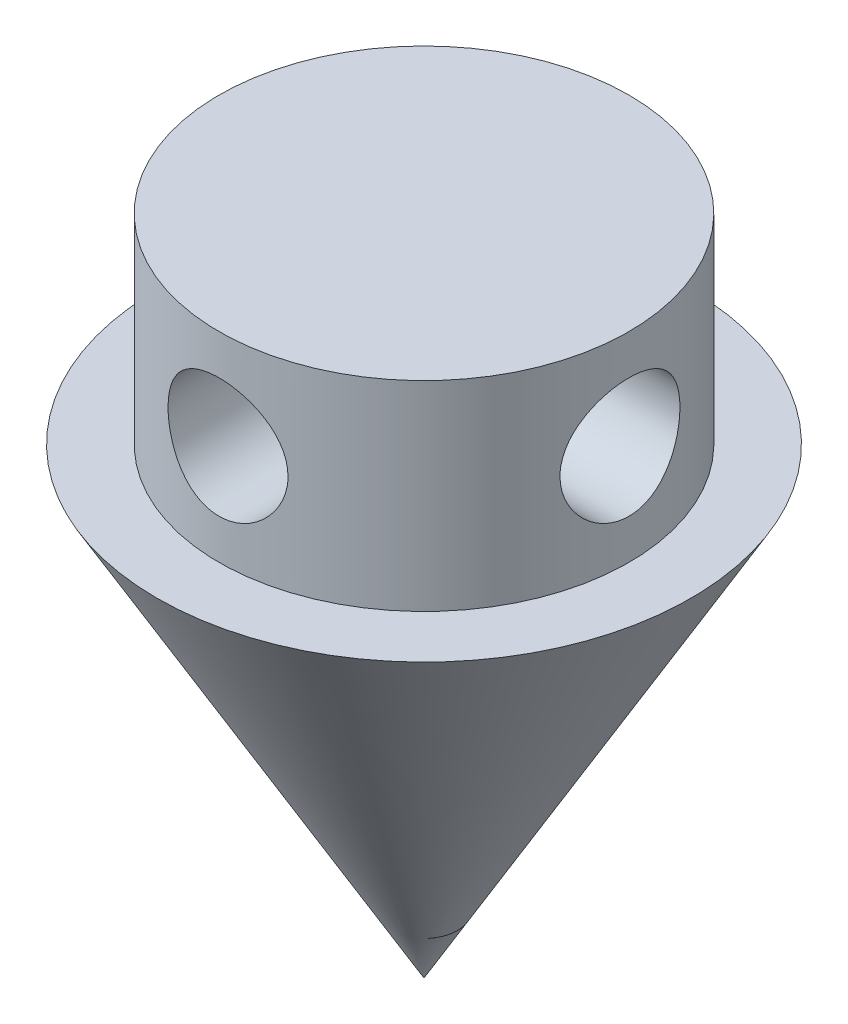
ISO-10303-21;
HEADER;
FILE_DESCRIPTION(('STEP AP214'),'2;1');
FILE_NAME('part.step','',(''),(''),'','','');
FILE_SCHEMA(('AUTOMOTIVE_DESIGN { 1 0 10303 214 1 1 1 1 }'));
ENDSEC;
DATA;
#1=APPLICATION_CONTEXT('core data for automotive mechanical design processes');
#2=APPLICATION_PROTOCOL_DEFINITION('international standard','automotive_design',2000,#1);
#3=PRODUCT_CONTEXT('',#1,'mechanical');
#4=PRODUCT('Part','Part','',(#3));
#5=PRODUCT_RELATED_PRODUCT_CATEGORY('part','',(#4));
#6=PRODUCT_DEFINITION_FORMATION('','',#4);
#7=PRODUCT_DEFINITION_CONTEXT('part definition',#1,'design');
#8=PRODUCT_DEFINITION('design','',#6,#7);
#9=PRODUCT_DEFINITION_SHAPE('','',#8);
#10=(LENGTH_UNIT() NAMED_UNIT(*) SI_UNIT(.MILLI.,.METRE.));
#11=(NAMED_UNIT(*) PLANE_ANGLE_UNIT() SI_UNIT($,.RADIAN.));
#12=(NAMED_UNIT(*) SI_UNIT($,.STERADIAN.) SOLID_ANGLE_UNIT());
#13=UNCERTAINTY_MEASURE_WITH_UNIT(LENGTH_MEASURE(1.E-05),#10,'distance_accuracy_value','');
#14=(GEOMETRIC_REPRESENTATION_CONTEXT(3) GLOBAL_UNCERTAINTY_ASSIGNED_CONTEXT((#13)) GLOBAL_UNIT_ASSIGNED_CONTEXT((#10,
#11,#12)) REPRESENTATION_CONTEXT('',''));
#15=CARTESIAN_POINT('',(0.,0.,0.));
#16=DIRECTION('',(0.,0.,1.));
#17=DIRECTION('',(1.,0.,0.));
#18=AXIS2_PLACEMENT_3D('',#15,#16,#17);
#19=CARTESIAN_POINT('',(0.,11.5614391405224,-13.35));
#20=DIRECTION('',(0.,0.,1.));
#21=DIRECTION('',(1.,0.,0.));
#22=AXIS2_PLACEMENT_3D('',#19,#20,#21);
#23=CYLINDRICAL_SURFACE('',#22,3.);
#24=CARTESIAN_POINT('',(3.,11.5614391405224,9.80114789195633));
#25=CARTESIAN_POINT('',(2.99999746175985,11.7260295810798,9.80114992506124));
#26=CARTESIAN_POINT('',(2.9864088999702,11.8906453429548,9.80533920128403));
#27=CARTESIAN_POINT('',(2.9325451017023,12.2150775547996,9.82158066680453));
#28=CARTESIAN_POINT('',(2.89225995318095,12.3748921991394,9.83363577654289));
#29=CARTESIAN_POINT('',(2.78647726144655,12.6849795507611,9.86412916611665));
#30=CARTESIAN_POINT('',(2.72102014804028,12.8352671113289,9.88255720535236));
#31=CARTESIAN_POINT('',(2.56688318178323,13.122761673286,9.92370640928456));
#32=CARTESIAN_POINT('',(2.47820022078772,13.2599669206106,9.946428148462));
#33=CARTESIAN_POINT('',(2.27726971309996,13.5215347739714,9.99437203581521));
#34=CARTESIAN_POINT('',(2.16444543498224,13.6454450472232,10.0196454780748));
#35=CARTESIAN_POINT('',(1.91967193383097,13.8728837589447,10.0694059010803));
#36=CARTESIAN_POINT('',(1.7877203710043,13.9764097001907,10.0938927851603));
#37=CARTESIAN_POINT('',(1.50523867042067,14.1620872958486,10.139901401077));
#38=CARTESIAN_POINT('',(1.35439515328406,14.2437803768345,10.1613556295932));
#39=CARTESIAN_POINT('',(1.04037763848688,14.3804671230856,10.1982873756147));
#40=CARTESIAN_POINT('',(0.877206173671745,14.4354662556248,10.213766116846));
#41=CARTESIAN_POINT('',(0.547894519269676,14.5157145269893,10.236639974182));
#42=CARTESIAN_POINT('',(0.381957126992254,14.5417351679288,10.24424432305));
#43=CARTESIAN_POINT('',(0.0479094620364565,14.5657245287612,10.2512482234745));
#44=CARTESIAN_POINT('',(-0.120200368782222,14.5636988660886,10.2506494180528));
#45=CARTESIAN_POINT('',(-0.448418210461296,14.5321768164533,10.2414636207862));
#46=CARTESIAN_POINT('',(-0.608614274223889,14.5035154368434,10.2331194489363));
#47=CARTESIAN_POINT('',(-0.921814438610707,14.4208960860025,10.209673607781));
#48=CARTESIAN_POINT('',(-1.07481809196999,14.3669365438717,10.1945715188427));
#49=CARTESIAN_POINT('',(-1.37130845089546,14.2346704568653,10.1589654768266));
#50=CARTESIAN_POINT('',(-1.51466825619629,14.1560959987988,10.1384024806187));
#51=CARTESIAN_POINT('',(-1.78643893277547,13.977040891629,10.0940637887971));
#52=CARTESIAN_POINT('',(-1.91484638560313,13.8765552481512,10.0702873611935));
#53=CARTESIAN_POINT('',(-2.1580517297572,13.6521755343641,10.0210421709353));
#54=CARTESIAN_POINT('',(-2.2721757449232,13.5275567062545,9.99554332724818));
#55=CARTESIAN_POINT('',(-2.47809018400086,13.2606965357992,9.94649703006864));
#56=CARTESIAN_POINT('',(-2.56987860504909,13.1184536148016,9.92294975170056));
#57=CARTESIAN_POINT('',(-2.72917424680686,12.8186813831543,9.88033381262632));
#58=CARTESIAN_POINT('',(-2.79646225313558,12.6610293423766,9.86130609096126));
#59=CARTESIAN_POINT('',(-2.90334074684968,12.3359475949958,9.83037351588997));
#60=CARTESIAN_POINT('',(-2.94293976047318,12.1685209155069,9.81846646998626));
#61=CARTESIAN_POINT('',(-2.99207926894961,11.8350310676649,9.8036014548583));
#62=CARTESIAN_POINT('',(-3.00263977750297,11.6691315934016,9.80033995432809));
#63=CARTESIAN_POINT('',(-2.99624231123474,11.3379292131317,9.80229797235934));
#64=CARTESIAN_POINT('',(-2.97928796892288,11.1726262312635,9.80751637140484));
#65=CARTESIAN_POINT('',(-2.9192485186782,10.8514878004266,9.82554934012221));
#66=CARTESIAN_POINT('',(-2.87681014585225,10.6955198079814,9.83817573292395));
#67=CARTESIAN_POINT('',(-2.76775194430911,10.3929251826043,9.86940957925653));
#68=CARTESIAN_POINT('',(-2.70112850661661,10.2462999476704,9.88801792538677));
#69=CARTESIAN_POINT('',(-2.54362592823572,9.96237722628921,9.92971539413577));
#70=CARTESIAN_POINT('',(-2.45216608315492,9.82541739064745,9.95290760824183));
#71=CARTESIAN_POINT('',(-2.24828329325139,9.56841601737129,10.0009335170437));
#72=CARTESIAN_POINT('',(-2.13585557596368,9.44837834230714,10.0257675846069));
#73=CARTESIAN_POINT('',(-1.88845042382828,9.22421963152815,10.0753512544242));
#74=CARTESIAN_POINT('',(-1.75281164397313,9.12081914605287,10.100066240598));
#75=CARTESIAN_POINT('',(-1.46552498874078,8.93823554808286,10.1457310844248));
#76=CARTESIAN_POINT('',(-1.31387793387754,8.85905119518533,10.1666811349032));
#77=CARTESIAN_POINT('',(-0.999909698792418,8.72790903687179,10.2023244539059));
#78=CARTESIAN_POINT('',(-0.837679874226138,8.67574593463424,10.2170647367549));
#79=CARTESIAN_POINT('',(-0.506250974025879,8.59958158691794,10.2388353876572));
#80=CARTESIAN_POINT('',(-0.337053800592509,8.57557270695177,10.245867845782));
#81=CARTESIAN_POINT('',(-0.00316772558191911,8.55695601800593,10.2513096938205));
#82=CARTESIAN_POINT('',(0.161458511169612,8.5613007294914,10.2500263123235));
#83=CARTESIAN_POINT('',(0.487535879532566,8.59678029756934,10.2396980948439));
#84=CARTESIAN_POINT('',(0.648987176021527,8.62791375921972,10.2306536629944));
#85=CARTESIAN_POINT('',(0.962601891125669,8.71545043788882,10.205901392709));
#86=CARTESIAN_POINT('',(1.11484075406039,8.77160332165168,10.1902596448812));
#87=CARTESIAN_POINT('',(1.40781835147558,8.90736174913451,10.1539334098905));
#88=CARTESIAN_POINT('',(1.54855524567556,8.98697103646166,10.1332481178764));
#89=CARTESIAN_POINT('',(1.81924959858925,9.17023355330338,10.0882233660288));
#90=CARTESIAN_POINT('',(1.94874063394236,9.27455270888884,10.0637908696803));
#91=CARTESIAN_POINT('',(2.18873061905263,9.50306014459776,10.0143398114442));
#92=CARTESIAN_POINT('',(2.29922419747139,9.62725402499714,9.98932108607079));
#93=CARTESIAN_POINT('',(2.50117621745975,9.89615525781999,9.94071065978621));
#94=CARTESIAN_POINT('',(2.59201612251893,10.0413390416371,9.9171784098105));
#95=CARTESIAN_POINT('',(2.74788601828594,10.3455850809944,9.87512931521937));
#96=CARTESIAN_POINT('',(2.8129294825627,10.504640038474,9.85660985401649));
#97=CARTESIAN_POINT('',(2.9088796666691,10.8123243873279,9.82868775299289));
#98=CARTESIAN_POINT('',(2.94295899417231,10.9598951243816,9.81845454172528));
#99=CARTESIAN_POINT('',(2.98851832278478,11.2587835982606,9.80468427057592));
#100=CARTESIAN_POINT('',(3.00000233387427,11.410100665399,9.80114602254644));
#101=CARTESIAN_POINT('',(3.,11.5614391405224,9.80114789195633));
#102=B_SPLINE_CURVE_WITH_KNOTS('',3,(#24,#25,#26,#27,#28,#29,#30,#31,#32,#33,#34,#35,#36,#37,
#38,#39,#40,#41,#42,#43,#44,#45,#46,#47,#48,#49,#50,#51,#52,#53,#54,#55,#56,#57,#58,#59,#60,#61,
#62,#63,#64,#65,#66,#67,#68,#69,#70,#71,#72,#73,#74,#75,#76,#77,#78,#79,#80,#81,#82,#83,#84,#85,
#86,#87,#88,#89,#90,#91,#92,#93,#94,#95,#96,#97,#98,#99,#100,#101),.UNSPECIFIED.,.T.,.F.,(4,2,2,
2,2,2,2,2,2,2,2,2,2,2,2,2,2,2,2,2,2,2,2,2,2,2,2,2,2,2,2,2,2,2,2,2,2,2,4),(0.,0.493213477867735,
0.986610181193144,1.47921770591635,1.97189118640388,2.47800183300104,2.98417444318164,
3.50026538700252,4.01625058391556,4.51814325809275,5.01993540892036,5.50650898832165,
5.9931127857135,6.48520851873253,6.9774165361481,7.48771965766661,7.99806852191934,
8.51287754331124,9.02752797028817,9.52385463831019,10.0201157866316,10.5042856424841,
10.9885277774821,11.48524602015,11.9820774583721,12.496632374002,13.0111609285975,
13.5217207430717,14.0321420786904,14.5238162221269,15.0154647646882,15.5023008584727,
15.9892146927003,16.4911482002169,16.9932233917966,17.5093353003962,18.0251772858578,
18.4787602865289,18.9322627827738),.UNSPECIFIED.);
#103=CARTESIAN_POINT('',(3.,11.5614391405224,9.80114789195633));
#104=VERTEX_POINT('',#103);
#105=EDGE_CURVE('E87',#104,#104,#102,.T.);
#106=ORIENTED_EDGE('',*,*,#105,.T.);
#107=EDGE_LOOP('',(#106));
#108=FACE_BOUND('',#107,.T.);
#109=CARTESIAN_POINT('',(0.,11.5614391405224,0.));
#110=DIRECTION('',(0.707106781186546,0.,0.707106781186549));
#111=DIRECTION('',(-0.707106781186549,0.,0.707106781186546));
#112=AXIS2_PLACEMENT_3D('',#109,#110,#111);
#113=ELLIPSE('',#112,4.24264068711928,3.);
#114=CARTESIAN_POINT('',(0.,8.56143914052242,0.));
#115=VERTEX_POINT('',#114);
#116=CARTESIAN_POINT('',(0.,14.5614391405224,0.));
#117=VERTEX_POINT('',#116);
#118=EDGE_CURVE('E52',#115,#117,#113,.F.);
#119=ORIENTED_EDGE('',*,*,#118,.T.);
#120=CARTESIAN_POINT('',(0.,11.5614391405224,0.));
#121=DIRECTION('',(-0.707106781186549,0.,0.707106781186546));
#122=DIRECTION('',(0.707106781186546,0.,0.707106781186549));
#123=AXIS2_PLACEMENT_3D('',#120,#121,#122);
#124=ELLIPSE('',#123,4.24264068711929,3.);
#125=EDGE_CURVE('E11',#117,#115,#124,.F.);
#126=ORIENTED_EDGE('',*,*,#125,.T.);
#127=EDGE_LOOP('',(#119,#126));
#128=FACE_BOUND('',#127,.T.);
#129=ADVANCED_FACE('F38',(#108,#128),#23,.F.);
#130=CARTESIAN_POINT('',(0.,-16.5614391405224,0.));
#131=DIRECTION('',(0.,1.,0.));
#132=DIRECTION('',(0.,0.,1.));
#133=AXIS2_PLACEMENT_3D('',#130,#131,#132);
#134=CONICAL_SURFACE('',#133,0.,0.523598775598293);
#135=CARTESIAN_POINT('',(0.,6.56143914052242,0.));
#136=DIRECTION('',(0.,-1.,0.));
#137=DIRECTION('',(0.,0.,-1.));
#138=AXIS2_PLACEMENT_3D('',#135,#136,#137);
#139=CIRCLE('',#138,13.35);
#140=CARTESIAN_POINT('',(0.,6.56143914052242,-13.35));
#141=VERTEX_POINT('',#140);
#142=EDGE_CURVE('E71',#141,#141,#139,.T.);
#143=ORIENTED_EDGE('',*,*,#142,.T.);
#144=EDGE_LOOP('',(#143));
#145=FACE_BOUND('',#144,.T.);
#146=CARTESIAN_POINT('',(0.,-16.5614391405224,0.));
#147=VERTEX_POINT('',#146);
#148=VERTEX_LOOP('',#147);
#149=FACE_BOUND('',#148,.T.);
#150=ADVANCED_FACE('F40',(#145,#149),#134,.T.);
#151=CARTESIAN_POINT('',(10.25,6.56143914052242,0.));
#152=DIRECTION('',(0.,1.,0.));
#153=DIRECTION('',(0.,0.,1.));
#154=AXIS2_PLACEMENT_3D('',#151,#152,#153);
#155=PLANE('',#154);
#156=CARTESIAN_POINT('',(0.,6.56143914052242,0.));
#157=DIRECTION('',(0.,-1.,0.));
#158=DIRECTION('',(0.,0.,-1.));
#159=AXIS2_PLACEMENT_3D('',#156,#157,#158);
#160=CIRCLE('',#159,10.25);
#161=CARTESIAN_POINT('',(0.,6.56143914052242,-10.25));
#162=VERTEX_POINT('',#161);
#163=EDGE_CURVE('E140',#162,#162,#160,.T.);
#164=ORIENTED_EDGE('',*,*,#163,.T.);
#165=EDGE_LOOP('',(#164));
#166=FACE_BOUND('',#165,.T.);
#167=ORIENTED_EDGE('',*,*,#142,.F.);
#168=EDGE_LOOP('',(#167));
#169=FACE_BOUND('',#168,.T.);
#170=ADVANCED_FACE('F108',(#166,#169),#155,.T.);
#171=CARTESIAN_POINT('',(0.,-24.573828125,0.));
#172=DIRECTION('',(0.,-1.,0.));
#173=DIRECTION('',(0.,0.,-1.));
#174=AXIS2_PLACEMENT_3D('',#171,#172,#173);
#175=CYLINDRICAL_SURFACE('',#174,10.25);
#176=CARTESIAN_POINT('',(9.80114789195632,11.5614391405224,3.00000000000004));
#177=CARTESIAN_POINT('',(9.80114992506123,11.396848699965,2.99999746175989));
#178=CARTESIAN_POINT('',(9.80533920128402,11.23223293809,2.98640889997023));
#179=CARTESIAN_POINT('',(9.82158066680452,10.9078007262452,2.93254510170233));
#180=CARTESIAN_POINT('',(9.83363577654288,10.7479860819054,2.89225995318098));
#181=CARTESIAN_POINT('',(9.86412916611664,10.4378987302838,2.78647726144659));
#182=CARTESIAN_POINT('',(9.88255720535235,10.2876111697159,2.72102014804032));
#183=CARTESIAN_POINT('',(9.92370640928455,10.0001166077588,2.56688318178327));
#184=CARTESIAN_POINT('',(9.946428148462,9.86291136043424,2.47820022078775));
#185=CARTESIAN_POINT('',(9.9943720358152,9.60134350707341,2.27726971309999));
#186=CARTESIAN_POINT('',(10.0196454780748,9.47743323382164,2.16444543498228));
#187=CARTESIAN_POINT('',(10.0694059010803,9.24999452210014,1.91967193383101));
#188=CARTESIAN_POINT('',(10.0938927851603,9.14646858085418,1.78772037100434));
#189=CARTESIAN_POINT('',(10.139901401077,8.96079098519629,1.5052386704207));
#190=CARTESIAN_POINT('',(10.1613556295932,8.87909790421037,1.3543951532841));
#191=CARTESIAN_POINT('',(10.1982873756147,8.74241115795922,1.04037763848692));
#192=CARTESIAN_POINT('',(10.213766116846,8.68741202542006,0.877206173671781));
#193=CARTESIAN_POINT('',(10.236639974182,8.60716375405558,0.547894519269712));
#194=CARTESIAN_POINT('',(10.24424432305,8.58114311311608,0.381957126992291));
#195=CARTESIAN_POINT('',(10.2512482234745,8.55715375228361,0.0479094620364925));
#196=CARTESIAN_POINT('',(10.2506494180528,8.55917941495624,-0.120200368782186));
#197=CARTESIAN_POINT('',(10.2414636207862,8.5907014645915,-0.448418210461261));
#198=CARTESIAN_POINT('',(10.2331194489363,8.61936284420148,-0.608614274223853));
#199=CARTESIAN_POINT('',(10.209673607781,8.70198219504235,-0.921814438610672));
#200=CARTESIAN_POINT('',(10.1945715188427,8.75594173717313,-1.07481809196995));
#201=CARTESIAN_POINT('',(10.1589654768266,8.88820782417959,-1.37130845089543));
#202=CARTESIAN_POINT('',(10.1384024806187,8.96678228224605,-1.51466825619626));
#203=CARTESIAN_POINT('',(10.0940637887972,9.14583738941588,-1.78643893277544));
#204=CARTESIAN_POINT('',(10.0702873611935,9.24632303289362,-1.9148463856031));
#205=CARTESIAN_POINT('',(10.0210421709354,9.47070274668069,-2.15805172975717));
#206=CARTESIAN_POINT('',(9.99554332724819,9.5953215747903,-2.27217574492316));
#207=CARTESIAN_POINT('',(9.94649703006865,9.86218174524562,-2.47809018400083));
#208=CARTESIAN_POINT('',(9.92294975170057,10.0044246662433,-2.56987860504905));
#209=CARTESIAN_POINT('',(9.88033381262633,10.3041968978905,-2.72917424680682));
#210=CARTESIAN_POINT('',(9.86130609096127,10.4618489386683,-2.79646225313554));
#211=CARTESIAN_POINT('',(9.83037351588998,10.786930686049,-2.90334074684965));
#212=CARTESIAN_POINT('',(9.81846646998626,10.954357365538,-2.94293976047314));
#213=CARTESIAN_POINT('',(9.80360145485831,11.2878472133799,-2.99207926894958));
#214=CARTESIAN_POINT('',(9.8003399543281,11.4537466876432,-3.00263977750294));
#215=CARTESIAN_POINT('',(9.80229797235935,11.7849490679132,-2.99624231123471));
#216=CARTESIAN_POINT('',(9.80751637140485,11.9502520497814,-2.97928796892284));
#217=CARTESIAN_POINT('',(9.82554934012222,12.2713904806182,-2.91924851867816));
#218=CARTESIAN_POINT('',(9.83817573292396,12.4273584730635,-2.87681014585222));
#219=CARTESIAN_POINT('',(9.86940957925654,12.7299530984405,-2.76775194430907));
#220=CARTESIAN_POINT('',(9.88801792538677,12.8765783333745,-2.70112850661658));
#221=CARTESIAN_POINT('',(9.92971539413578,13.1605010547556,-2.54362592823568));
#222=CARTESIAN_POINT('',(9.95290760824184,13.2974608903974,-2.45216608315488));
#223=CARTESIAN_POINT('',(10.0009335170437,13.5544622636736,-2.24828329325135));
#224=CARTESIAN_POINT('',(10.0257675846069,13.6744999387377,-2.13585557596364));
#225=CARTESIAN_POINT('',(10.0753512544242,13.8986586495167,-1.88845042382824));
#226=CARTESIAN_POINT('',(10.100066240598,14.002059134992,-1.7528116439731));
#227=CARTESIAN_POINT('',(10.1457310844248,14.184642732962,-1.46552498874074));
#228=CARTESIAN_POINT('',(10.1666811349032,14.2638270858595,-1.31387793387751));
#229=CARTESIAN_POINT('',(10.2023244539059,14.3949692441731,-0.999909698792381));
#230=CARTESIAN_POINT('',(10.2170647367549,14.4471323464106,-0.837679874226101));
#231=CARTESIAN_POINT('',(10.2388353876572,14.5232966941269,-0.506250974025841));
#232=CARTESIAN_POINT('',(10.245867845782,14.5473055740931,-0.337053800592471));
#233=CARTESIAN_POINT('',(10.2513096938205,14.5659222630389,-0.00316772558188059));
#234=CARTESIAN_POINT('',(10.2500263123235,14.5615775515534,0.16145851116965));
#235=CARTESIAN_POINT('',(10.2396980948439,14.5260979834755,0.487535879532605));
#236=CARTESIAN_POINT('',(10.2306536629944,14.4949645218251,0.648987176021566));
#237=CARTESIAN_POINT('',(10.205901392709,14.407427843156,0.962601891125708));
#238=CARTESIAN_POINT('',(10.1902596448812,14.3512749593932,1.11484075406042));
#239=CARTESIAN_POINT('',(10.1539334098905,14.2155165319103,1.40781835147562));
#240=CARTESIAN_POINT('',(10.1332481178764,14.1359072445832,1.5485552456756));
#241=CARTESIAN_POINT('',(10.0882233660288,13.9526447277415,1.81924959858929));
#242=CARTESIAN_POINT('',(10.0637908696803,13.848325572156,1.9487406339424));
#243=CARTESIAN_POINT('',(10.0143398114442,13.6198181364471,2.18873061905267));
#244=CARTESIAN_POINT('',(9.98932108607078,13.4956242560477,2.29922419747143));
#245=CARTESIAN_POINT('',(9.9407106597862,13.2267230232248,2.50117621745978));
#246=CARTESIAN_POINT('',(9.91717840981049,13.0815392394077,2.59201612251897));
#247=CARTESIAN_POINT('',(9.87512931521936,12.7772932000505,2.74788601828597));
#248=CARTESIAN_POINT('',(9.85660985401648,12.6182382425709,2.81292948256273));
#249=CARTESIAN_POINT('',(9.82868775299288,12.3105538937169,2.90887966666913));
#250=CARTESIAN_POINT('',(9.81845454172527,12.1629831566633,2.94295899417235));
#251=CARTESIAN_POINT('',(9.80468427057591,11.8640946827843,2.98851832278481));
#252=CARTESIAN_POINT('',(9.80114602254643,11.7127776156459,3.0000023338743));
#253=CARTESIAN_POINT('',(9.80114789195632,11.5614391405224,3.00000000000004));
#254=B_SPLINE_CURVE_WITH_KNOTS('',3,(#176,#177,#178,#179,#180,#181,#182,#183,#184,#185,#186,
#187,#188,#189,#190,#191,#192,#193,#194,#195,#196,#197,#198,#199,#200,#201,#202,#203,#204,#205,
#206,#207,#208,#209,#210,#211,#212,#213,#214,#215,#216,#217,#218,#219,#220,#221,#222,#223,#224,
#225,#226,#227,#228,#229,#230,#231,#232,#233,#234,#235,#236,#237,#238,#239,#240,#241,#242,#243,
#244,#245,#246,#247,#248,#249,#250,#251,#252,#253),.UNSPECIFIED.,.T.,.F.,(4,2,2,2,2,2,2,2,2,2,2,
2,2,2,2,2,2,2,2,2,2,2,2,2,2,2,2,2,2,2,2,2,2,2,2,2,2,2,4),(0.,0.493213477867735,
0.986610181193144,1.47921770591635,1.97189118640388,2.47800183300104,2.98417444318164,
3.50026538700252,4.01625058391556,4.51814325809275,5.01993540892036,5.50650898832165,
5.9931127857135,6.48520851873254,6.9774165361481,7.48771965766661,7.99806852191934,
8.51287754331123,9.02752797028817,9.52385463831018,10.0201157866316,10.5042856424841,
10.9885277774821,11.48524602015,11.9820774583721,12.496632374002,13.0111609285975,
13.5217207430717,14.0321420786904,14.5238162221269,15.0154647646882,15.5023008584727,
15.9892146927003,16.4911482002169,16.9932233917967,17.5093353003962,18.0251772858578,
18.4787602865289,18.9322627827738),.UNSPECIFIED.);
#255=CARTESIAN_POINT('',(9.80114789195632,11.5614391405224,3.00000000000004));
#256=VERTEX_POINT('',#255);
#257=EDGE_CURVE('E120',#256,#256,#254,.T.);
#258=ORIENTED_EDGE('',*,*,#257,.F.);
#259=EDGE_LOOP('',(#258));
#260=FACE_BOUND('',#259,.T.);
#261=CARTESIAN_POINT('',(-9.80114789195634,11.5614391405224,2.99999999999997));
#262=CARTESIAN_POINT('',(-9.80114992506125,11.7260295810798,2.99999746175982));
#263=CARTESIAN_POINT('',(-9.80533920128404,11.8906453429548,2.98640889997016));
#264=CARTESIAN_POINT('',(-9.82158066680454,12.2150775547996,2.93254510170226));
#265=CARTESIAN_POINT('',(-9.8336357765429,12.3748921991394,2.89225995318091));
#266=CARTESIAN_POINT('',(-9.86412916611667,12.6849795507611,2.78647726144652));
#267=CARTESIAN_POINT('',(-9.88255720535236,12.8352671113289,2.72102014804025));
#268=CARTESIAN_POINT('',(-9.92370640928457,13.122761673286,2.5668831817832));
#269=CARTESIAN_POINT('',(-9.94642814846201,13.2599669206106,2.47820022078768));
#270=CARTESIAN_POINT('',(-9.99437203581522,13.5215347739714,2.27726971309992));
#271=CARTESIAN_POINT('',(-10.0196454780748,13.6454450472232,2.16444543498221));
#272=CARTESIAN_POINT('',(-10.0694059010804,13.8728837589447,1.91967193383094));
#273=CARTESIAN_POINT('',(-10.0938927851603,13.9764097001907,1.78772037100426));
#274=CARTESIAN_POINT('',(-10.1399014010771,14.1620872958486,1.50523867042063));
#275=CARTESIAN_POINT('',(-10.1613556295932,14.2437803768345,1.35439515328403));
#276=CARTESIAN_POINT('',(-10.1982873756147,14.3804671230856,1.04037763848685));
#277=CARTESIAN_POINT('',(-10.213766116846,14.4354662556248,0.87720617367171));
#278=CARTESIAN_POINT('',(-10.236639974182,14.5157145269893,0.547894519269641));
#279=CARTESIAN_POINT('',(-10.24424432305,14.5417351679288,0.38195712699222));
#280=CARTESIAN_POINT('',(-10.2512482234745,14.5657245287612,0.0479094620364218));
#281=CARTESIAN_POINT('',(-10.2506494180528,14.5636988660886,-0.120200368782257));
#282=CARTESIAN_POINT('',(-10.2414636207862,14.5321768164533,-0.448418210461331));
#283=CARTESIAN_POINT('',(-10.2331194489362,14.5035154368434,-0.608614274223923));
#284=CARTESIAN_POINT('',(-10.209673607781,14.4208960860025,-0.921814438610742));
#285=CARTESIAN_POINT('',(-10.1945715188427,14.3669365438717,-1.07481809197002));
#286=CARTESIAN_POINT('',(-10.1589654768266,14.2346704568653,-1.3713084508955));
#287=CARTESIAN_POINT('',(-10.1384024806187,14.1560959987988,-1.51466825619633));
#288=CARTESIAN_POINT('',(-10.0940637887971,13.977040891629,-1.78643893277551));
#289=CARTESIAN_POINT('',(-10.0702873611935,13.8765552481512,-1.91484638560317));
#290=CARTESIAN_POINT('',(-10.0210421709353,13.6521755343641,-2.15805172975724));
#291=CARTESIAN_POINT('',(-9.99554332724817,13.5275567062545,-2.27217574492323));
#292=CARTESIAN_POINT('',(-9.94649703006863,13.2606965357992,-2.4780901840009));
#293=CARTESIAN_POINT('',(-9.92294975170055,13.1184536148016,-2.56987860504912));
#294=CARTESIAN_POINT('',(-9.88033381262631,12.8186813831544,-2.72917424680689));
#295=CARTESIAN_POINT('',(-9.86130609096125,12.6610293423766,-2.79646225313561));
#296=CARTESIAN_POINT('',(-9.83037351588996,12.3359475949958,-2.90334074684971));
#297=CARTESIAN_POINT('',(-9.81846646998624,12.1685209155069,-2.94293976047321));
#298=CARTESIAN_POINT('',(-9.80360145485828,11.8350310676649,-2.99207926894964));
#299=CARTESIAN_POINT('',(-9.80033995432808,11.6691315934016,-3.00263977750301));
#300=CARTESIAN_POINT('',(-9.80229797235933,11.3379292131317,-2.99624231123477));
#301=CARTESIAN_POINT('',(-9.80751637140483,11.1726262312635,-2.97928796892291));
#302=CARTESIAN_POINT('',(-9.8255493401222,10.8514878004266,-2.91924851867823));
#303=CARTESIAN_POINT('',(-9.83817573292394,10.6955198079814,-2.87681014585229));
#304=CARTESIAN_POINT('',(-9.86940957925652,10.3929251826043,-2.76775194430914));
#305=CARTESIAN_POINT('',(-9.88801792538676,10.2462999476704,-2.70112850661664));
#306=CARTESIAN_POINT('',(-9.92971539413576,9.9623772262892,-2.54362592823575));
#307=CARTESIAN_POINT('',(-9.95290760824182,9.82541739064745,-2.45216608315495));
#308=CARTESIAN_POINT('',(-10.0009335170437,9.56841601737129,-2.24828329325142));
#309=CARTESIAN_POINT('',(-10.0257675846069,9.44837834230714,-2.13585557596371));
#310=CARTESIAN_POINT('',(-10.0753512544242,9.22421963152815,-1.88845042382831));
#311=CARTESIAN_POINT('',(-10.100066240598,9.12081914605287,-1.75281164397317));
#312=CARTESIAN_POINT('',(-10.1457310844248,8.93823554808286,-1.46552498874082));
#313=CARTESIAN_POINT('',(-10.1666811349032,8.85905119518533,-1.31387793387758));
#314=CARTESIAN_POINT('',(-10.2023244539059,8.72790903687179,-0.999909698792453));
#315=CARTESIAN_POINT('',(-10.2170647367549,8.67574593463424,-0.837679874226173));
#316=CARTESIAN_POINT('',(-10.2388353876572,8.59958158691794,-0.506250974025913));
#317=CARTESIAN_POINT('',(-10.245867845782,8.57557270695177,-0.337053800592543));
#318=CARTESIAN_POINT('',(-10.2513096938205,8.55695601800593,-0.0031677255819531));
#319=CARTESIAN_POINT('',(-10.2500263123235,8.5613007294914,0.161458511169578));
#320=CARTESIAN_POINT('',(-10.239698094844,8.59678029756934,0.487535879532532));
#321=CARTESIAN_POINT('',(-10.2306536629944,8.62791375921972,0.648987176021493));
#322=CARTESIAN_POINT('',(-10.205901392709,8.71545043788882,0.962601891125636));
#323=CARTESIAN_POINT('',(-10.1902596448812,8.77160332165168,1.11484075406035));
#324=CARTESIAN_POINT('',(-10.1539334098905,8.90736174913451,1.40781835147555));
#325=CARTESIAN_POINT('',(-10.1332481178764,8.98697103646166,1.54855524567553));
#326=CARTESIAN_POINT('',(-10.0882233660288,9.17023355330338,1.81924959858922));
#327=CARTESIAN_POINT('',(-10.0637908696803,9.27455270888884,1.94874063394233));
#328=CARTESIAN_POINT('',(-10.0143398114442,9.50306014459776,2.1887306190526));
#329=CARTESIAN_POINT('',(-9.9893210860708,9.62725402499714,2.29922419747135));
#330=CARTESIAN_POINT('',(-9.94071065978622,9.89615525781999,2.50117621745971));
#331=CARTESIAN_POINT('',(-9.91717840981051,10.0413390416371,2.5920161225189));
#332=CARTESIAN_POINT('',(-9.87512931521938,10.3455850809944,2.7478860182859));
#333=CARTESIAN_POINT('',(-9.8566098540165,10.504640038474,2.81292948256266));
#334=CARTESIAN_POINT('',(-9.8286877529929,10.8123243873279,2.90887966666907));
#335=CARTESIAN_POINT('',(-9.81845454172529,10.9598951243816,2.94295899417228));
#336=CARTESIAN_POINT('',(-9.80468427057593,11.2587835982606,2.98851832278475));
#337=CARTESIAN_POINT('',(-9.80114602254645,11.410100665399,3.00000233387423));
#338=CARTESIAN_POINT('',(-9.80114789195634,11.5614391405224,2.99999999999997));
#339=B_SPLINE_CURVE_WITH_KNOTS('',3,(#261,#262,#263,#264,#265,#266,#267,#268,#269,#270,#271,
#272,#273,#274,#275,#276,#277,#278,#279,#280,#281,#282,#283,#284,#285,#286,#287,#288,#289,#290,
#291,#292,#293,#294,#295,#296,#297,#298,#299,#300,#301,#302,#303,#304,#305,#306,#307,#308,#309,
#310,#311,#312,#313,#314,#315,#316,#317,#318,#319,#320,#321,#322,#323,#324,#325,#326,#327,#328,
#329,#330,#331,#332,#333,#334,#335,#336,#337,#338),.UNSPECIFIED.,.T.,.F.,(4,2,2,2,2,2,2,2,2,2,2,
2,2,2,2,2,2,2,2,2,2,2,2,2,2,2,2,2,2,2,2,2,2,2,2,2,2,2,4),(0.,0.493213477867735,
0.986610181193144,1.47921770591635,1.97189118640388,2.47800183300104,2.98417444318164,
3.50026538700252,4.01625058391556,4.51814325809275,5.01993540892036,5.50650898832165,
5.9931127857135,6.48520851873253,6.9774165361481,7.48771965766661,7.99806852191934,
8.51287754331123,9.02752797028817,9.52385463831018,10.0201157866316,10.5042856424841,
10.9885277774821,11.48524602015,11.9820774583721,12.496632374002,13.0111609285975,
13.5217207430717,14.0321420786904,14.5238162221268,15.0154647646882,15.5023008584727,
15.9892146927003,16.4911482002169,16.9932233917966,17.5093353003962,18.0251772858578,
18.4787602865289,18.9322627827738),.UNSPECIFIED.);
#340=CARTESIAN_POINT('',(-9.80114789195634,11.5614391405224,2.99999999999997));
#341=VERTEX_POINT('',#340);
#342=EDGE_CURVE('E123',#341,#341,#339,.T.);
#343=ORIENTED_EDGE('',*,*,#342,.F.);
#344=EDGE_LOOP('',(#343));
#345=FACE_BOUND('',#344,.T.);
#346=CARTESIAN_POINT('',(0.,14.5614391405224,-10.25));
#347=CARTESIAN_POINT('',(0.164761030351972,14.5614366595759,-10.2499982885748));
#348=CARTESIAN_POINT('',(0.329547295458404,14.5478209092509,-10.2459891477057));
#349=CARTESIAN_POINT('',(0.654332795535695,14.4938393392971,-10.230386996352));
#350=CARTESIAN_POINT('',(0.81433038545475,14.4534644348852,-10.2187914102722));
#351=CARTESIAN_POINT('',(1.12480632609575,14.3474195573488,-10.1892890680163));
#352=CARTESIAN_POINT('',(1.27529796475204,14.28178584603,-10.1713913623467));
#353=CARTESIAN_POINT('',(1.56313982492937,14.127231944821,-10.1311520971023));
#354=CARTESIAN_POINT('',(1.70048848640622,14.0383089952163,-10.1088100109555));
#355=CARTESIAN_POINT('',(1.96191733576444,13.8371264688352,-10.0613857012864));
#356=CARTESIAN_POINT('',(2.08558550559553,13.7243442640026,-10.0362493869492));
#357=CARTESIAN_POINT('',(2.31255048619464,13.4797592987022,-9.98639778591535));
#358=CARTESIAN_POINT('',(2.41584406583257,13.3479535270885,-9.96168256656547));
#359=CARTESIAN_POINT('',(2.60125899002276,13.0656221112895,-9.91490371417962));
#360=CARTESIAN_POINT('',(2.68288409015477,12.9147583469992,-9.89290754305841));
#361=CARTESIAN_POINT('',(2.81943980977289,12.6006983983844,-9.8548627546537));
#362=CARTESIAN_POINT('',(2.87437649194788,12.4375050246648,-9.83881278679458));
#363=CARTESIAN_POINT('',(2.95452269393277,12.1080311799745,-9.81504013380612));
#364=CARTESIAN_POINT('',(2.98048902579986,11.9419504704895,-9.80710592181538));
#365=CARTESIAN_POINT('',(3.00431990686238,11.6076151032002,-9.79983320781897));
#366=CARTESIAN_POINT('',(3.00219089805733,11.4393609525846,-9.80049273534855));
#367=CARTESIAN_POINT('',(2.97048742281734,11.1115509753171,-9.81014508286663));
#368=CARTESIAN_POINT('',(2.94185346758437,10.9518944003535,-9.81885231917808));
#369=CARTESIAN_POINT('',(2.85946944140989,10.6397580622811,-9.84315807045729));
#370=CARTESIAN_POINT('',(2.80571699957747,10.4872789781391,-9.85875723593485));
#371=CARTESIAN_POINT('',(2.67391255524925,10.1914911660074,-9.89532234434978));
#372=CARTESIAN_POINT('',(2.59554994462267,10.0483296048996,-9.91635624177806));
#373=CARTESIAN_POINT('',(2.41696561895684,9.7768695330498,-9.9613872850994));
#374=CARTESIAN_POINT('',(2.31673882796467,9.64857448430129,-9.98538511853289));
#375=CARTESIAN_POINT('',(2.09256856581136,9.40514550906533,-10.0348053395161));
#376=CARTESIAN_POINT('',(1.96784238280467,9.29073498975115,-10.0602464857032));
#377=CARTESIAN_POINT('',(1.70065773106955,9.08429041714504,-10.1088414191559));
#378=CARTESIAN_POINT('',(1.55819825155491,8.99225764025352,-10.1319950759012));
#379=CARTESIAN_POINT('',(1.25832091873287,8.8327700662714,-10.1736007103458));
#380=CARTESIAN_POINT('',(1.10081695121618,8.76546894808863,-10.1920230825114));
#381=CARTESIAN_POINT('',(0.776062838465761,8.65852152349337,-10.2218771397365));
#382=CARTESIAN_POINT('',(0.608815288482841,8.61886788919937,-10.2333106770663));
#383=CARTESIAN_POINT('',(0.275476791208134,8.56952964328029,-10.2476087603624));
#384=CARTESIAN_POINT('',(0.109542867087529,8.55886393231937,-10.2507537181414));
#385=CARTESIAN_POINT('',(-0.221751346556176,8.56506366890141,-10.2489391883311));
#386=CARTESIAN_POINT('',(-0.387111705972303,8.58192563477439,-10.2439807256534));
#387=CARTESIAN_POINT('',(-0.708907880964287,8.64190585860449,-10.2266995731309));
#388=CARTESIAN_POINT('',(-0.8654587958639,8.68445679251574,-10.2145361074543));
#389=CARTESIAN_POINT('',(-1.16917031023221,8.79392997885417,-10.1842453367686));
#390=CARTESIAN_POINT('',(-1.31632979951197,8.86085510638014,-10.1661173282263));
#391=CARTESIAN_POINT('',(-1.60073763334111,9.01886280309106,-10.1252781031291));
#392=CARTESIAN_POINT('',(-1.7376904484053,9.11045250966582,-10.1024733915115));
#393=CARTESIAN_POINT('',(-1.99461950577328,9.31456855645158,-10.0549039781344));
#394=CARTESIAN_POINT('',(-2.11459168317154,9.42709989489618,-10.0301388092763));
#395=CARTESIAN_POINT('',(-2.33843282820621,9.67450941868942,-9.98037315954646));
#396=CARTESIAN_POINT('',(-2.44160478686513,9.81002382265752,-9.95539395570076));
#397=CARTESIAN_POINT('',(-2.62378498624162,10.096983433787,-9.90894158446663));
#398=CARTESIAN_POINT('',(-2.70279397633861,10.2484281466972,-9.88746830835656));
#399=CARTESIAN_POINT('',(-2.83384433731139,10.5623867633403,-9.85070881104072));
#400=CARTESIAN_POINT('',(-2.88602104776955,10.7248403427403,-9.83539162636926));
#401=CARTESIAN_POINT('',(-2.9621376686088,11.0567551042299,-9.81273906354755));
#402=CARTESIAN_POINT('',(-2.98608666871315,11.2262140123005,-9.80540111602868));
#403=CARTESIAN_POINT('',(-3.00447077094816,11.5601133020306,-9.79978244305745));
#404=CARTESIAN_POINT('',(-3.00003820655236,11.7244863318157,-9.80115420912));
#405=CARTESIAN_POINT('',(-2.96447047001477,12.0500331444269,-9.8119698726704));
#406=CARTESIAN_POINT('',(-2.93333627294418,12.2112070438565,-9.82141347539663));
#407=CARTESIAN_POINT('',(-2.8459639231665,12.5240273867956,-9.84708138643155));
#408=CARTESIAN_POINT('',(-2.79001188127977,12.6757605586313,-9.8632282841048));
#409=CARTESIAN_POINT('',(-2.65481394126726,12.9678064708418,-9.9004725781971));
#410=CARTESIAN_POINT('',(-2.57556375480526,13.1081171026684,-9.92157088584529));
#411=CARTESIAN_POINT('',(-2.39278153609463,13.3786244793645,-9.96725898827188));
#412=CARTESIAN_POINT('',(-2.28849929196275,13.5082980895561,-9.99194486293671));
#413=CARTESIAN_POINT('',(-2.05998084382639,13.7486726569119,-10.0415451100341));
#414=CARTESIAN_POINT('',(-1.93573954751622,13.8593687572595,-10.0664595392459));
#415=CARTESIAN_POINT('',(-1.66673369726187,14.0616557081263,-10.11452652781));
#416=CARTESIAN_POINT('',(-1.52150065002675,14.1526410115388,-10.1376122367225));
#417=CARTESIAN_POINT('',(-1.21712309212918,14.3087707786663,-10.1786359424675));
#418=CARTESIAN_POINT('',(-1.05798571107092,14.3739283920184,-10.1965765575289));
#419=CARTESIAN_POINT('',(-0.750037329507708,14.4700924665476,-10.2235467251828));
#420=CARTESIAN_POINT('',(-0.60227727406556,14.5042578208987,-10.2333870177589));
#421=CARTESIAN_POINT('',(-0.303018218768165,14.5499306082426,-10.2466139606282));
#422=CARTESIAN_POINT('',(-0.151519780227636,14.5614414220842,-10.2500015738841));
#423=CARTESIAN_POINT('',(0.,14.5614391405224,-10.25));
#424=B_SPLINE_CURVE_WITH_KNOTS('',3,(#346,#347,#348,#349,#350,#351,#352,#353,#354,#355,#356,
#357,#358,#359,#360,#361,#362,#363,#364,#365,#366,#367,#368,#369,#370,#371,#372,#373,#374,#375,
#376,#377,#378,#379,#380,#381,#382,#383,#384,#385,#386,#387,#388,#389,#390,#391,#392,#393,#394,
#395,#396,#397,#398,#399,#400,#401,#402,#403,#404,#405,#406,#407,#408,#409,#410,#411,#412,#413,
#414,#415,#416,#417,#418,#419,#420,#421,#422,#423),.UNSPECIFIED.,.T.,.F.,(4,2,2,2,2,2,2,2,2,2,2,
2,2,2,2,2,2,2,2,2,2,2,2,2,2,2,2,2,2,2,2,2,2,2,2,2,2,2,4),(0.,0.493726734338207,
0.987621175753447,1.48080920633221,1.97405570488177,2.47949748421679,2.98501935534299,
3.50127745347596,4.01741822065636,4.51973447382358,5.02193555256149,5.50697252332598,
5.99205528514922,6.48352459901597,6.97510813326561,7.48618028214055,7.99728157514173,
8.51150712228777,9.02559632365172,9.52205577525038,10.0184524400735,10.5042682205151,
10.9901413247397,11.4868885964294,11.9837545814407,12.4977349514636,13.0116993795141,
13.5230453442766,14.0342266033578,14.5251440018394,15.0160434741124,15.5014250662542,
15.9868960553894,16.4892919380903,16.991816205067,17.5080888117488,18.0240982301968,
18.4782137015786,18.9322613979278),.UNSPECIFIED.);
#425=CARTESIAN_POINT('',(0.,14.5614391405224,-10.25));
#426=VERTEX_POINT('',#425);
#427=EDGE_CURVE('E77',#426,#426,#424,.T.);
#428=ORIENTED_EDGE('',*,*,#427,.F.);
#429=EDGE_LOOP('',(#428));
#430=FACE_BOUND('',#429,.T.);
#431=ORIENTED_EDGE('',*,*,#105,.F.);
#432=EDGE_LOOP('',(#431));
#433=FACE_BOUND('',#432,.T.);
#434=CARTESIAN_POINT('',(0.,16.5614391405224,0.));
#435=DIRECTION('',(0.,-1.,0.));
#436=DIRECTION('',(0.,0.,-1.));
#437=AXIS2_PLACEMENT_3D('',#434,#435,#436);
#438=CIRCLE('',#437,10.25);
#439=CARTESIAN_POINT('',(0.,16.5614391405224,-10.25));
#440=VERTEX_POINT('',#439);
#441=EDGE_CURVE('E86',#440,#440,#438,.T.);
#442=ORIENTED_EDGE('',*,*,#441,.T.);
#443=EDGE_LOOP('',(#442));
#444=FACE_BOUND('',#443,.T.);
#445=ORIENTED_EDGE('',*,*,#163,.F.);
#446=EDGE_LOOP('',(#445));
#447=FACE_BOUND('',#446,.T.);
#448=ADVANCED_FACE('F92',(#260,#345,#430,#433,#444,#447),#175,.T.);
#449=CARTESIAN_POINT('',(0.,16.5614391405224,0.));
#450=DIRECTION('',(0.,1.,0.));
#451=DIRECTION('',(0.,0.,1.));
#452=AXIS2_PLACEMENT_3D('',#449,#450,#451);
#453=PLANE('',#452);
#454=ORIENTED_EDGE('',*,*,#441,.F.);
#455=EDGE_LOOP('',(#454));
#456=FACE_BOUND('',#455,.T.);
#457=ADVANCED_FACE('F98',(#456),#453,.T.);
#458=CARTESIAN_POINT('',(0.,11.5614391405224,0.));
#459=DIRECTION('',(0.707106781186546,0.,0.707106781186549));
#460=DIRECTION('',(-0.707106781186549,0.,0.707106781186546));
#461=AXIS2_PLACEMENT_3D('',#458,#459,#460);
#462=ELLIPSE('',#461,4.24264068711928,3.);
#463=EDGE_CURVE('E62',#115,#117,#462,.T.);
#464=ORIENTED_EDGE('',*,*,#463,.T.);
#465=CARTESIAN_POINT('',(0.,11.5614391405224,0.));
#466=DIRECTION('',(-0.707106781186549,0.,0.707106781186546));
#467=DIRECTION('',(0.707106781186546,0.,0.707106781186549));
#468=AXIS2_PLACEMENT_3D('',#465,#466,#467);
#469=ELLIPSE('',#468,4.24264068711929,3.);
#470=EDGE_CURVE('E47',#117,#115,#469,.T.);
#471=ORIENTED_EDGE('',*,*,#470,.T.);
#472=EDGE_LOOP('',(#464,#471));
#473=FACE_BOUND('',#472,.T.);
#474=ORIENTED_EDGE('',*,*,#427,.T.);
#475=EDGE_LOOP('',(#474));
#476=FACE_BOUND('',#475,.T.);
#477=ADVANCED_FACE('F73',(#473,#476),#23,.F.);
#478=CARTESIAN_POINT('',(13.35,11.5614391405224,0.));
#479=DIRECTION('',(-1.,0.,0.));
#480=DIRECTION('',(0.,0.,1.));
#481=AXIS2_PLACEMENT_3D('',#478,#479,#480);
#482=CYLINDRICAL_SURFACE('',#481,3.);
#483=ORIENTED_EDGE('',*,*,#342,.T.);
#484=EDGE_LOOP('',(#483));
#485=FACE_BOUND('',#484,.T.);
#486=ORIENTED_EDGE('',*,*,#118,.F.);
#487=ORIENTED_EDGE('',*,*,#470,.F.);
#488=EDGE_LOOP('',(#486,#487));
#489=FACE_BOUND('',#488,.T.);
#490=ADVANCED_FACE('F69',(#485,#489),#482,.F.);
#491=ORIENTED_EDGE('',*,*,#257,.T.);
#492=EDGE_LOOP('',(#491));
#493=FACE_BOUND('',#492,.T.);
#494=ORIENTED_EDGE('',*,*,#463,.F.);
#495=ORIENTED_EDGE('',*,*,#125,.F.);
#496=EDGE_LOOP('',(#494,#495));
#497=FACE_BOUND('',#496,.T.);
#498=ADVANCED_FACE('F63',(#493,#497),#482,.F.);
#499=CLOSED_SHELL('',(#129,#150,#170,#448,#457,#477,#490,#498));
#500=MANIFOLD_SOLID_BREP('B2',#499);
#501=ADVANCED_BREP_SHAPE_REPRESENTATION('',(#18,#500),#14);
#502=SHAPE_DEFINITION_REPRESENTATION(#9,#501);
ENDSEC;
END-ISO-10303-21;
